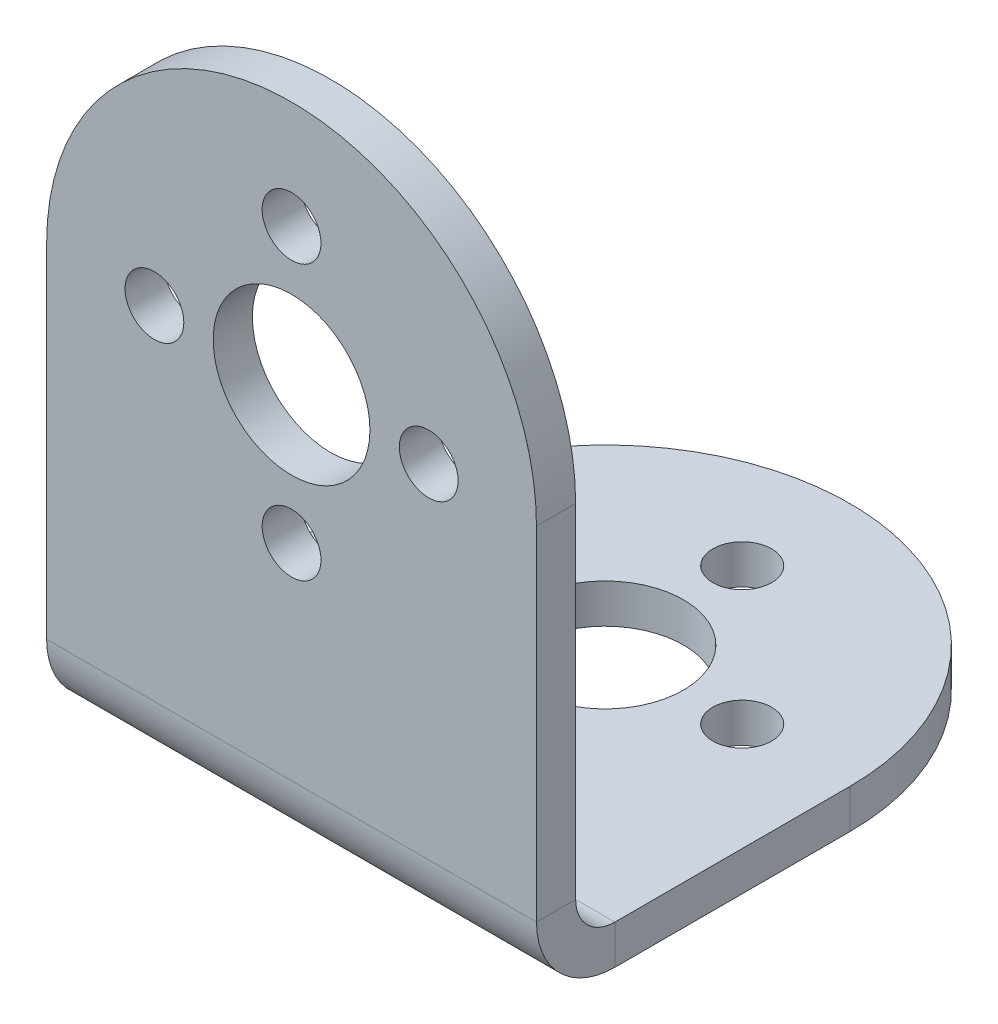
ISO-10303-21;
HEADER;
FILE_DESCRIPTION(('STEP AP214'),'2;1');
FILE_NAME('part.step','',(''),(''),'','','');
FILE_SCHEMA(('AUTOMOTIVE_DESIGN { 1 0 10303 214 1 1 1 1 }'));
ENDSEC;
DATA;
#1=APPLICATION_CONTEXT('core data for automotive mechanical design processes');
#2=APPLICATION_PROTOCOL_DEFINITION('international standard','automotive_design',2000,#1);
#3=PRODUCT_CONTEXT('',#1,'mechanical');
#4=PRODUCT('Part','Part','',(#3));
#5=PRODUCT_RELATED_PRODUCT_CATEGORY('part','',(#4));
#6=PRODUCT_DEFINITION_FORMATION('','',#4);
#7=PRODUCT_DEFINITION_CONTEXT('part definition',#1,'design');
#8=PRODUCT_DEFINITION('design','',#6,#7);
#9=PRODUCT_DEFINITION_SHAPE('','',#8);
#10=(LENGTH_UNIT() NAMED_UNIT(*) SI_UNIT(.MILLI.,.METRE.));
#11=(NAMED_UNIT(*) PLANE_ANGLE_UNIT() SI_UNIT($,.RADIAN.));
#12=(NAMED_UNIT(*) SI_UNIT($,.STERADIAN.) SOLID_ANGLE_UNIT());
#13=UNCERTAINTY_MEASURE_WITH_UNIT(LENGTH_MEASURE(1.E-05),#10,'distance_accuracy_value','');
#14=(GEOMETRIC_REPRESENTATION_CONTEXT(3) GLOBAL_UNCERTAINTY_ASSIGNED_CONTEXT((#13)) GLOBAL_UNIT_ASSIGNED_CONTEXT((#10,
#11,#12)) REPRESENTATION_CONTEXT('',''));
#15=CARTESIAN_POINT('',(0.,0.,0.));
#16=DIRECTION('',(0.,0.,1.));
#17=DIRECTION('',(1.,0.,0.));
#18=AXIS2_PLACEMENT_3D('',#15,#16,#17);
#19=CARTESIAN_POINT('',(0.,-1.99999999999999,0.));
#20=DIRECTION('',(0.,1.,0.));
#21=DIRECTION('',(0.,0.,1.));
#22=AXIS2_PLACEMENT_3D('',#19,#20,#21);
#23=PLANE('',#22);
#24=CARTESIAN_POINT('',(7.,-2.00000000000019,-16.));
#25=DIRECTION('',(0.,1.,0.));
#26=DIRECTION('',(0.,0.,1.));
#27=AXIS2_PLACEMENT_3D('',#24,#25,#26);
#28=CIRCLE('',#27,1.5);
#29=CARTESIAN_POINT('',(7.,-2.00000000000019,-14.5));
#30=VERTEX_POINT('',#29);
#31=EDGE_CURVE('E575',#30,#30,#28,.T.);
#32=ORIENTED_EDGE('',*,*,#31,.T.);
#33=EDGE_LOOP('',(#32));
#34=FACE_BOUND('',#33,.T.);
#35=CARTESIAN_POINT('',(-7.,-2.00000000000019,-16.));
#36=DIRECTION('',(0.,1.,0.));
#37=DIRECTION('',(0.,0.,1.));
#38=AXIS2_PLACEMENT_3D('',#35,#36,#37);
#39=CIRCLE('',#38,1.5);
#40=CARTESIAN_POINT('',(-7.,-2.00000000000019,-14.5));
#41=VERTEX_POINT('',#40);
#42=EDGE_CURVE('E569',#41,#41,#39,.T.);
#43=ORIENTED_EDGE('',*,*,#42,.T.);
#44=EDGE_LOOP('',(#43));
#45=FACE_BOUND('',#44,.T.);
#46=CARTESIAN_POINT('',(0.,-2.00000000000021,-23.));
#47=DIRECTION('',(0.,1.,0.));
#48=DIRECTION('',(0.,0.,1.));
#49=AXIS2_PLACEMENT_3D('',#46,#47,#48);
#50=CIRCLE('',#49,1.5);
#51=CARTESIAN_POINT('',(0.,-2.00000000000021,-21.5));
#52=VERTEX_POINT('',#51);
#53=EDGE_CURVE('E563',#52,#52,#50,.T.);
#54=ORIENTED_EDGE('',*,*,#53,.T.);
#55=EDGE_LOOP('',(#54));
#56=FACE_BOUND('',#55,.T.);
#57=CARTESIAN_POINT('',(0.,-2.00000000000017,-8.99999999999999));
#58=DIRECTION('',(0.,1.,0.));
#59=DIRECTION('',(0.,0.,1.));
#60=AXIS2_PLACEMENT_3D('',#57,#58,#59);
#61=CIRCLE('',#60,1.5);
#62=CARTESIAN_POINT('',(0.,-2.00000000000016,-7.49999999999999));
#63=VERTEX_POINT('',#62);
#64=EDGE_CURVE('E170',#63,#63,#61,.T.);
#65=ORIENTED_EDGE('',*,*,#64,.T.);
#66=EDGE_LOOP('',(#65));
#67=FACE_BOUND('',#66,.T.);
#68=CARTESIAN_POINT('',(0.,-2.00000000000015,-16.));
#69=DIRECTION('',(0.,1.,0.));
#70=DIRECTION('',(0.,0.,1.));
#71=AXIS2_PLACEMENT_3D('',#68,#69,#70);
#72=CIRCLE('',#71,4.);
#73=CARTESIAN_POINT('',(0.,-2.00000000000013,-12.));
#74=VERTEX_POINT('',#73);
#75=EDGE_CURVE('E551',#74,#74,#72,.T.);
#76=ORIENTED_EDGE('',*,*,#75,.T.);
#77=EDGE_LOOP('',(#76));
#78=FACE_BOUND('',#77,.T.);
#79=CARTESIAN_POINT('',(0.,-2.00000000000006,-16.));
#80=DIRECTION('',(0.,1.,0.));
#81=DIRECTION('',(0.,0.,1.));
#82=AXIS2_PLACEMENT_3D('',#79,#80,#81);
#83=CIRCLE('',#82,12.5);
#84=CARTESIAN_POINT('',(12.5,-2.00000000000005,-16.));
#85=VERTEX_POINT('',#84);
#86=CARTESIAN_POINT('',(-12.5,-2.00000000000005,-16.));
#87=VERTEX_POINT('',#86);
#88=EDGE_CURVE('E162',#85,#87,#83,.T.);
#89=ORIENTED_EDGE('',*,*,#88,.F.);
#90=DIRECTION('',(0.,0.,1.));
#91=VECTOR('',#90,1.);
#92=CARTESIAN_POINT('',(12.5,-2.,-1.99999999999999));
#93=LINE('',#92,#91);
#94=CARTESIAN_POINT('',(12.5,-2.,-3.99999999999999));
#95=VERTEX_POINT('',#94);
#96=EDGE_CURVE('E169',#85,#95,#93,.T.);
#97=ORIENTED_EDGE('',*,*,#96,.T.);
#98=DIRECTION('',(1.,0.,0.));
#99=VECTOR('',#98,1.);
#100=CARTESIAN_POINT('',(0.,-2.00000000000001,-3.99999999999999));
#101=LINE('',#100,#99);
#102=CARTESIAN_POINT('',(-12.5,-2.00000000000001,-3.99999999999999));
#103=VERTEX_POINT('',#102);
#104=EDGE_CURVE('E180',#103,#95,#101,.T.);
#105=ORIENTED_EDGE('',*,*,#104,.F.);
#106=DIRECTION('',(0.,0.,-1.));
#107=VECTOR('',#106,1.);
#108=CARTESIAN_POINT('',(-12.5,-2.00000000000009,-28.5));
#109=LINE('',#108,#107);
#110=EDGE_CURVE('E175',#103,#87,#109,.T.);
#111=ORIENTED_EDGE('',*,*,#110,.T.);
#112=EDGE_LOOP('',(#89,#97,#105,#111));
#113=FACE_BOUND('',#112,.T.);
#114=ADVANCED_FACE('F85',(#34,#45,#56,#67,#78,#113),#23,.F.);
#115=CARTESIAN_POINT('',(0.,0.,0.));
#116=DIRECTION('',(0.,1.,0.));
#117=DIRECTION('',(0.,0.,1.));
#118=AXIS2_PLACEMENT_3D('',#115,#116,#117);
#119=PLANE('',#118);
#120=CARTESIAN_POINT('',(7.,0.,-16.));
#121=DIRECTION('',(0.,1.,0.));
#122=DIRECTION('',(0.,0.,1.));
#123=AXIS2_PLACEMENT_3D('',#120,#121,#122);
#124=CIRCLE('',#123,1.49999999999999);
#125=CARTESIAN_POINT('',(7.,0.,-14.5));
#126=VERTEX_POINT('',#125);
#127=EDGE_CURVE('E577',#126,#126,#124,.T.);
#128=ORIENTED_EDGE('',*,*,#127,.F.);
#129=EDGE_LOOP('',(#128));
#130=FACE_BOUND('',#129,.T.);
#131=CARTESIAN_POINT('',(-7.,0.,-16.));
#132=DIRECTION('',(0.,1.,0.));
#133=DIRECTION('',(0.,0.,1.));
#134=AXIS2_PLACEMENT_3D('',#131,#132,#133);
#135=CIRCLE('',#134,1.49999999999999);
#136=CARTESIAN_POINT('',(-7.,0.,-14.5));
#137=VERTEX_POINT('',#136);
#138=EDGE_CURVE('E572',#137,#137,#135,.T.);
#139=ORIENTED_EDGE('',*,*,#138,.F.);
#140=EDGE_LOOP('',(#139));
#141=FACE_BOUND('',#140,.T.);
#142=CARTESIAN_POINT('',(0.,0.,-23.));
#143=DIRECTION('',(0.,1.,0.));
#144=DIRECTION('',(0.,0.,1.));
#145=AXIS2_PLACEMENT_3D('',#142,#143,#144);
#146=CIRCLE('',#145,1.49999999999999);
#147=CARTESIAN_POINT('',(0.,0.,-21.5));
#148=VERTEX_POINT('',#147);
#149=EDGE_CURVE('E566',#148,#148,#146,.T.);
#150=ORIENTED_EDGE('',*,*,#149,.F.);
#151=EDGE_LOOP('',(#150));
#152=FACE_BOUND('',#151,.T.);
#153=CARTESIAN_POINT('',(0.,0.,-8.99999999999999));
#154=DIRECTION('',(0.,1.,0.));
#155=DIRECTION('',(0.,0.,1.));
#156=AXIS2_PLACEMENT_3D('',#153,#154,#155);
#157=CIRCLE('',#156,1.49999999999999);
#158=CARTESIAN_POINT('',(0.,0.,-7.50000000000001));
#159=VERTEX_POINT('',#158);
#160=EDGE_CURVE('E560',#159,#159,#157,.T.);
#161=ORIENTED_EDGE('',*,*,#160,.F.);
#162=EDGE_LOOP('',(#161));
#163=FACE_BOUND('',#162,.T.);
#164=CARTESIAN_POINT('',(0.,-1.48318857196017E-13,-16.));
#165=DIRECTION('',(0.,1.,0.));
#166=DIRECTION('',(0.,0.,1.));
#167=AXIS2_PLACEMENT_3D('',#164,#165,#166);
#168=CIRCLE('',#167,4.);
#169=CARTESIAN_POINT('',(0.,-1.34352931840644E-13,-12.));
#170=VERTEX_POINT('',#169);
#171=EDGE_CURVE('E550',#170,#170,#168,.T.);
#172=ORIENTED_EDGE('',*,*,#171,.F.);
#173=EDGE_LOOP('',(#172));
#174=FACE_BOUND('',#173,.T.);
#175=DIRECTION('',(0.,0.,1.));
#176=VECTOR('',#175,1.);
#177=CARTESIAN_POINT('',(12.5,0.,-2.));
#178=LINE('',#177,#176);
#179=CARTESIAN_POINT('',(12.5,0.,-16.));
#180=VERTEX_POINT('',#179);
#181=CARTESIAN_POINT('',(12.5,0.,-3.99999999999999));
#182=VERTEX_POINT('',#181);
#183=EDGE_CURVE('E167',#180,#182,#178,.T.);
#184=ORIENTED_EDGE('',*,*,#183,.F.);
#185=CARTESIAN_POINT('',(0.,0.,-16.));
#186=DIRECTION('',(0.,1.,0.));
#187=DIRECTION('',(0.,0.,1.));
#188=AXIS2_PLACEMENT_3D('',#185,#186,#187);
#189=CIRCLE('',#188,12.5);
#190=CARTESIAN_POINT('',(-12.5,0.,-16.));
#191=VERTEX_POINT('',#190);
#192=EDGE_CURVE('E151',#180,#191,#189,.T.);
#193=ORIENTED_EDGE('',*,*,#192,.T.);
#194=DIRECTION('',(0.,0.,-1.));
#195=VECTOR('',#194,1.);
#196=CARTESIAN_POINT('',(-12.5,0.,-28.5));
#197=LINE('',#196,#195);
#198=CARTESIAN_POINT('',(-12.5,0.,-3.99999999999999));
#199=VERTEX_POINT('',#198);
#200=EDGE_CURVE('E176',#199,#191,#197,.T.);
#201=ORIENTED_EDGE('',*,*,#200,.F.);
#202=DIRECTION('',(-1.,0.,0.));
#203=VECTOR('',#202,1.);
#204=CARTESIAN_POINT('',(12.5,0.,-3.99999999999999));
#205=LINE('',#204,#203);
#206=EDGE_CURVE('E174',#182,#199,#205,.T.);
#207=ORIENTED_EDGE('',*,*,#206,.F.);
#208=EDGE_LOOP('',(#184,#193,#201,#207));
#209=FACE_BOUND('',#208,.T.);
#210=ADVANCED_FACE('F173',(#130,#141,#152,#163,#174,#209),#119,.T.);
#211=CARTESIAN_POINT('',(-12.5,-2.00000000000009,-28.5));
#212=DIRECTION('',(1.,0.,0.));
#213=DIRECTION('',(0.,0.,-1.));
#214=AXIS2_PLACEMENT_3D('',#211,#212,#213);
#215=PLANE('',#214);
#216=DIRECTION('',(0.,1.,0.));
#217=VECTOR('',#216,1.);
#218=CARTESIAN_POINT('',(-12.5,0.,-16.));
#219=LINE('',#218,#217);
#220=EDGE_CURVE('E157',#191,#87,#219,.F.);
#221=ORIENTED_EDGE('',*,*,#220,.T.);
#222=ORIENTED_EDGE('',*,*,#110,.F.);
#223=DIRECTION('',(0.,-1.,0.));
#224=VECTOR('',#223,1.);
#225=CARTESIAN_POINT('',(-12.5,0.,-3.99999999999999));
#226=LINE('',#225,#224);
#227=EDGE_CURVE('E238',#199,#103,#226,.T.);
#228=ORIENTED_EDGE('',*,*,#227,.F.);
#229=ORIENTED_EDGE('',*,*,#200,.T.);
#230=EDGE_LOOP('',(#221,#222,#228,#229));
#231=FACE_BOUND('',#230,.T.);
#232=ADVANCED_FACE('F271',(#231),#215,.F.);
#233=CARTESIAN_POINT('',(-12.5,0.,-2.));
#234=DIRECTION('',(-1.,0.,0.));
#235=DIRECTION('',(0.,0.,1.));
#236=AXIS2_PLACEMENT_3D('',#233,#234,#235);
#237=PLANE('',#236);
#238=DIRECTION('',(0.,-1.,0.));
#239=VECTOR('',#238,1.);
#240=CARTESIAN_POINT('',(-12.5,0.,-2.));
#241=LINE('',#240,#239);
#242=CARTESIAN_POINT('',(-12.5,19.5,-2.));
#243=VERTEX_POINT('',#242);
#244=CARTESIAN_POINT('',(-12.5,2.,-2.));
#245=VERTEX_POINT('',#244);
#246=EDGE_CURVE('E205',#243,#245,#241,.T.);
#247=ORIENTED_EDGE('',*,*,#246,.T.);
#248=DIRECTION('',(0.,0.,1.));
#249=VECTOR('',#248,1.);
#250=CARTESIAN_POINT('',(-12.5,1.99999999999999,-2.));
#251=LINE('',#250,#249);
#252=CARTESIAN_POINT('',(-12.5,1.99999999999999,0.));
#253=VERTEX_POINT('',#252);
#254=EDGE_CURVE('E191',#245,#253,#251,.T.);
#255=ORIENTED_EDGE('',*,*,#254,.T.);
#256=DIRECTION('',(0.,-1.,0.));
#257=VECTOR('',#256,1.);
#258=CARTESIAN_POINT('',(-12.5,0.,0.));
#259=LINE('',#258,#257);
#260=CARTESIAN_POINT('',(-12.5,19.5,0.));
#261=VERTEX_POINT('',#260);
#262=EDGE_CURVE('E203',#261,#253,#259,.T.);
#263=ORIENTED_EDGE('',*,*,#262,.F.);
#264=DIRECTION('',(0.,0.,1.));
#265=VECTOR('',#264,1.);
#266=CARTESIAN_POINT('',(-12.5,19.5,-2.));
#267=LINE('',#266,#265);
#268=EDGE_CURVE('E12',#243,#261,#267,.T.);
#269=ORIENTED_EDGE('',*,*,#268,.F.);
#270=EDGE_LOOP('',(#247,#255,#263,#269));
#271=FACE_BOUND('',#270,.T.);
#272=ADVANCED_FACE('F87',(#271),#237,.T.);
#273=CARTESIAN_POINT('',(0.,19.5,-2.));
#274=DIRECTION('',(0.,0.,-1.));
#275=DIRECTION('',(-1.,0.,0.));
#276=AXIS2_PLACEMENT_3D('',#273,#274,#275);
#277=PLANE('',#276);
#278=CARTESIAN_POINT('',(0.,26.5,-2.));
#279=DIRECTION('',(0.,0.,-1.));
#280=DIRECTION('',(-1.,0.,0.));
#281=AXIS2_PLACEMENT_3D('',#278,#279,#280);
#282=CIRCLE('',#281,1.49999999999999);
#283=CARTESIAN_POINT('',(-1.49999999999999,26.5,-2.));
#284=VERTEX_POINT('',#283);
#285=EDGE_CURVE('E546',#284,#284,#282,.T.);
#286=ORIENTED_EDGE('',*,*,#285,.F.);
#287=EDGE_LOOP('',(#286));
#288=FACE_BOUND('',#287,.T.);
#289=CARTESIAN_POINT('',(-7.,19.5,-2.));
#290=DIRECTION('',(0.,0.,-1.));
#291=DIRECTION('',(-1.,0.,0.));
#292=AXIS2_PLACEMENT_3D('',#289,#290,#291);
#293=CIRCLE('',#292,1.49999999999999);
#294=CARTESIAN_POINT('',(-8.49999999999999,19.5,-2.));
#295=VERTEX_POINT('',#294);
#296=EDGE_CURVE('E542',#295,#295,#293,.T.);
#297=ORIENTED_EDGE('',*,*,#296,.F.);
#298=EDGE_LOOP('',(#297));
#299=FACE_BOUND('',#298,.T.);
#300=CARTESIAN_POINT('',(0.,12.5,-2.));
#301=DIRECTION('',(0.,0.,-1.));
#302=DIRECTION('',(-1.,0.,0.));
#303=AXIS2_PLACEMENT_3D('',#300,#301,#302);
#304=CIRCLE('',#303,1.49999999999999);
#305=CARTESIAN_POINT('',(-1.49999999999999,12.5,-2.));
#306=VERTEX_POINT('',#305);
#307=EDGE_CURVE('E538',#306,#306,#304,.T.);
#308=ORIENTED_EDGE('',*,*,#307,.F.);
#309=EDGE_LOOP('',(#308));
#310=FACE_BOUND('',#309,.T.);
#311=CARTESIAN_POINT('',(7.,19.5,-2.));
#312=DIRECTION('',(0.,0.,-1.));
#313=DIRECTION('',(-1.,0.,0.));
#314=AXIS2_PLACEMENT_3D('',#311,#312,#313);
#315=CIRCLE('',#314,1.49999999999999);
#316=CARTESIAN_POINT('',(5.50000000000001,19.5,-2.));
#317=VERTEX_POINT('',#316);
#318=EDGE_CURVE('E532',#317,#317,#315,.T.);
#319=ORIENTED_EDGE('',*,*,#318,.F.);
#320=EDGE_LOOP('',(#319));
#321=FACE_BOUND('',#320,.T.);
#322=CARTESIAN_POINT('',(0.,19.5,-2.));
#323=DIRECTION('',(0.,0.,-1.));
#324=DIRECTION('',(-1.,0.,0.));
#325=AXIS2_PLACEMENT_3D('',#322,#323,#324);
#326=CIRCLE('',#325,4.);
#327=CARTESIAN_POINT('',(-4.,19.5,-2.));
#328=VERTEX_POINT('',#327);
#329=EDGE_CURVE('E242',#328,#328,#326,.T.);
#330=ORIENTED_EDGE('',*,*,#329,.F.);
#331=EDGE_LOOP('',(#330));
#332=FACE_BOUND('',#331,.T.);
#333=DIRECTION('',(0.,1.,0.));
#334=VECTOR('',#333,1.);
#335=CARTESIAN_POINT('',(12.5,0.,-2.));
#336=LINE('',#335,#334);
#337=CARTESIAN_POINT('',(12.5,2.,-2.));
#338=VERTEX_POINT('',#337);
#339=CARTESIAN_POINT('',(12.5,19.5,-2.));
#340=VERTEX_POINT('',#339);
#341=EDGE_CURVE('E207',#338,#340,#336,.T.);
#342=ORIENTED_EDGE('',*,*,#341,.F.);
#343=DIRECTION('',(-1.,0.,0.));
#344=VECTOR('',#343,1.);
#345=CARTESIAN_POINT('',(-12.5,1.99999999999999,-2.));
#346=LINE('',#345,#344);
#347=EDGE_CURVE('E107',#245,#338,#346,.F.);
#348=ORIENTED_EDGE('',*,*,#347,.F.);
#349=ORIENTED_EDGE('',*,*,#246,.F.);
#350=CARTESIAN_POINT('',(0.,19.5,-2.));
#351=DIRECTION('',(0.,0.,1.));
#352=DIRECTION('',(-1.,0.,0.));
#353=AXIS2_PLACEMENT_3D('',#350,#351,#352);
#354=CIRCLE('',#353,12.5);
#355=EDGE_CURVE('E210',#340,#243,#354,.T.);
#356=ORIENTED_EDGE('',*,*,#355,.F.);
#357=EDGE_LOOP('',(#342,#348,#349,#356));
#358=FACE_BOUND('',#357,.T.);
#359=ADVANCED_FACE('F466',(#288,#299,#310,#321,#332,#358),#277,.T.);
#360=CARTESIAN_POINT('',(0.,19.5,0.));
#361=DIRECTION('',(0.,0.,-1.));
#362=DIRECTION('',(-1.,0.,0.));
#363=AXIS2_PLACEMENT_3D('',#360,#361,#362);
#364=PLANE('',#363);
#365=CARTESIAN_POINT('',(0.,26.5,0.));
#366=DIRECTION('',(0.,0.,1.));
#367=DIRECTION('',(1.,0.,0.));
#368=AXIS2_PLACEMENT_3D('',#365,#366,#367);
#369=CIRCLE('',#368,1.49999999999999);
#370=CARTESIAN_POINT('',(1.49999999999999,26.5,0.));
#371=VERTEX_POINT('',#370);
#372=EDGE_CURVE('E515',#371,#371,#369,.T.);
#373=ORIENTED_EDGE('',*,*,#372,.F.);
#374=EDGE_LOOP('',(#373));
#375=FACE_BOUND('',#374,.T.);
#376=CARTESIAN_POINT('',(-7.,19.5,0.));
#377=DIRECTION('',(0.,0.,1.));
#378=DIRECTION('',(1.,0.,0.));
#379=AXIS2_PLACEMENT_3D('',#376,#377,#378);
#380=CIRCLE('',#379,1.49999999999999);
#381=CARTESIAN_POINT('',(-5.50000000000001,19.5,0.));
#382=VERTEX_POINT('',#381);
#383=EDGE_CURVE('E519',#382,#382,#380,.T.);
#384=ORIENTED_EDGE('',*,*,#383,.F.);
#385=EDGE_LOOP('',(#384));
#386=FACE_BOUND('',#385,.T.);
#387=CARTESIAN_POINT('',(0.,12.5,0.));
#388=DIRECTION('',(0.,0.,1.));
#389=DIRECTION('',(1.,0.,0.));
#390=AXIS2_PLACEMENT_3D('',#387,#388,#389);
#391=CIRCLE('',#390,1.49999999999999);
#392=CARTESIAN_POINT('',(1.49999999999999,12.5,0.));
#393=VERTEX_POINT('',#392);
#394=EDGE_CURVE('E523',#393,#393,#391,.T.);
#395=ORIENTED_EDGE('',*,*,#394,.F.);
#396=EDGE_LOOP('',(#395));
#397=FACE_BOUND('',#396,.T.);
#398=CARTESIAN_POINT('',(7.,19.5,0.));
#399=DIRECTION('',(0.,0.,1.));
#400=DIRECTION('',(1.,0.,0.));
#401=AXIS2_PLACEMENT_3D('',#398,#399,#400);
#402=CIRCLE('',#401,1.49999999999999);
#403=CARTESIAN_POINT('',(8.49999999999999,19.5,0.));
#404=VERTEX_POINT('',#403);
#405=EDGE_CURVE('E527',#404,#404,#402,.T.);
#406=ORIENTED_EDGE('',*,*,#405,.F.);
#407=EDGE_LOOP('',(#406));
#408=FACE_BOUND('',#407,.T.);
#409=CARTESIAN_POINT('',(0.,19.5,0.));
#410=DIRECTION('',(0.,0.,1.));
#411=DIRECTION('',(1.,0.,0.));
#412=AXIS2_PLACEMENT_3D('',#409,#410,#411);
#413=CIRCLE('',#412,4.);
#414=CARTESIAN_POINT('',(4.,19.5,0.));
#415=VERTEX_POINT('',#414);
#416=EDGE_CURVE('E530',#415,#415,#413,.T.);
#417=ORIENTED_EDGE('',*,*,#416,.F.);
#418=EDGE_LOOP('',(#417));
#419=FACE_BOUND('',#418,.T.);
#420=DIRECTION('',(-1.,0.,0.));
#421=VECTOR('',#420,1.);
#422=CARTESIAN_POINT('',(-12.5,1.99999999999999,0.));
#423=LINE('',#422,#421);
#424=CARTESIAN_POINT('',(12.5,2.,0.));
#425=VERTEX_POINT('',#424);
#426=EDGE_CURVE('E184',#253,#425,#423,.F.);
#427=ORIENTED_EDGE('',*,*,#426,.T.);
#428=DIRECTION('',(0.,1.,0.));
#429=VECTOR('',#428,1.);
#430=CARTESIAN_POINT('',(12.5,0.,0.));
#431=LINE('',#430,#429);
#432=CARTESIAN_POINT('',(12.5,19.5,0.));
#433=VERTEX_POINT('',#432);
#434=EDGE_CURVE('E215',#425,#433,#431,.T.);
#435=ORIENTED_EDGE('',*,*,#434,.T.);
#436=CARTESIAN_POINT('',(0.,19.5,0.));
#437=DIRECTION('',(0.,0.,1.));
#438=DIRECTION('',(-1.,0.,0.));
#439=AXIS2_PLACEMENT_3D('',#436,#437,#438);
#440=CIRCLE('',#439,12.5);
#441=EDGE_CURVE('E208',#433,#261,#440,.T.);
#442=ORIENTED_EDGE('',*,*,#441,.T.);
#443=ORIENTED_EDGE('',*,*,#262,.T.);
#444=EDGE_LOOP('',(#427,#435,#442,#443));
#445=FACE_BOUND('',#444,.T.);
#446=ADVANCED_FACE('F220',(#375,#386,#397,#408,#419,#445),#364,.F.);
#447=CARTESIAN_POINT('',(0.,19.5,-2.));
#448=DIRECTION('',(0.,0.,1.));
#449=DIRECTION('',(1.,0.,0.));
#450=AXIS2_PLACEMENT_3D('',#447,#448,#449);
#451=CYLINDRICAL_SURFACE('',#450,12.5);
#452=ORIENTED_EDGE('',*,*,#441,.F.);
#453=DIRECTION('',(0.,0.,1.));
#454=VECTOR('',#453,1.);
#455=CARTESIAN_POINT('',(12.5,19.5,-2.));
#456=LINE('',#455,#454);
#457=EDGE_CURVE('E89',#340,#433,#456,.T.);
#458=ORIENTED_EDGE('',*,*,#457,.F.);
#459=ORIENTED_EDGE('',*,*,#355,.T.);
#460=ORIENTED_EDGE('',*,*,#268,.T.);
#461=EDGE_LOOP('',(#452,#458,#459,#460));
#462=FACE_BOUND('',#461,.T.);
#463=ADVANCED_FACE('F226',(#462),#451,.T.);
#464=CARTESIAN_POINT('',(12.5,0.,-2.));
#465=DIRECTION('',(1.,0.,0.));
#466=DIRECTION('',(0.,1.,0.));
#467=AXIS2_PLACEMENT_3D('',#464,#465,#466);
#468=PLANE('',#467);
#469=DIRECTION('',(0.,0.,1.));
#470=VECTOR('',#469,1.);
#471=CARTESIAN_POINT('',(12.5,2.,-2.));
#472=LINE('',#471,#470);
#473=EDGE_CURVE('E100',#338,#425,#472,.T.);
#474=ORIENTED_EDGE('',*,*,#473,.F.);
#475=ORIENTED_EDGE('',*,*,#341,.T.);
#476=ORIENTED_EDGE('',*,*,#457,.T.);
#477=ORIENTED_EDGE('',*,*,#434,.F.);
#478=EDGE_LOOP('',(#474,#475,#476,#477));
#479=FACE_BOUND('',#478,.T.);
#480=ADVANCED_FACE('F257',(#479),#468,.T.);
#481=CARTESIAN_POINT('',(12.5,2.,-4.));
#482=DIRECTION('',(1.,0.,0.));
#483=DIRECTION('',(0.,1.,0.));
#484=AXIS2_PLACEMENT_3D('',#481,#482,#483);
#485=PLANE('',#484);
#486=DIRECTION('',(0.,-1.,0.));
#487=VECTOR('',#486,1.);
#488=CARTESIAN_POINT('',(12.5,0.,-3.99999999999999));
#489=LINE('',#488,#487);
#490=EDGE_CURVE('E239',#182,#95,#489,.T.);
#491=ORIENTED_EDGE('',*,*,#490,.F.);
#492=CARTESIAN_POINT('',(12.5,2.,-4.));
#493=DIRECTION('',(-1.,0.,0.));
#494=DIRECTION('',(0.,-1.,0.));
#495=AXIS2_PLACEMENT_3D('',#492,#493,#494);
#496=CIRCLE('',#495,2.);
#497=EDGE_CURVE('E194',#338,#182,#496,.F.);
#498=ORIENTED_EDGE('',*,*,#497,.F.);
#499=ORIENTED_EDGE('',*,*,#473,.T.);
#500=CARTESIAN_POINT('',(12.5,2.,-4.));
#501=DIRECTION('',(-1.,0.,0.));
#502=DIRECTION('',(0.,-1.,0.));
#503=AXIS2_PLACEMENT_3D('',#500,#501,#502);
#504=CIRCLE('',#503,4.);
#505=EDGE_CURVE('E187',#425,#95,#504,.F.);
#506=ORIENTED_EDGE('',*,*,#505,.T.);
#507=EDGE_LOOP('',(#491,#498,#499,#506));
#508=FACE_BOUND('',#507,.T.);
#509=ADVANCED_FACE('F255',(#508),#485,.T.);
#510=CARTESIAN_POINT('',(-12.5,1.99999999999999,-4.));
#511=DIRECTION('',(1.,0.,0.));
#512=DIRECTION('',(0.,1.,0.));
#513=AXIS2_PLACEMENT_3D('',#510,#511,#512);
#514=PLANE('',#513);
#515=CARTESIAN_POINT('',(-12.5,1.99999999999999,-4.));
#516=DIRECTION('',(-1.,0.,0.));
#517=DIRECTION('',(0.,-1.,0.));
#518=AXIS2_PLACEMENT_3D('',#515,#516,#517);
#519=CIRCLE('',#518,2.);
#520=EDGE_CURVE('E199',#199,#245,#519,.T.);
#521=ORIENTED_EDGE('',*,*,#520,.F.);
#522=ORIENTED_EDGE('',*,*,#227,.T.);
#523=CARTESIAN_POINT('',(-12.5,1.99999999999999,-4.));
#524=DIRECTION('',(-1.,0.,0.));
#525=DIRECTION('',(0.,-1.,0.));
#526=AXIS2_PLACEMENT_3D('',#523,#524,#525);
#527=CIRCLE('',#526,4.);
#528=EDGE_CURVE('E188',#103,#253,#527,.T.);
#529=ORIENTED_EDGE('',*,*,#528,.T.);
#530=ORIENTED_EDGE('',*,*,#254,.F.);
#531=EDGE_LOOP('',(#521,#522,#529,#530));
#532=FACE_BOUND('',#531,.T.);
#533=ADVANCED_FACE('F232',(#532),#514,.F.);
#534=CARTESIAN_POINT('',(-12.5,1.99999999999999,-4.));
#535=DIRECTION('',(-1.,0.,0.));
#536=DIRECTION('',(0.,-1.,0.));
#537=AXIS2_PLACEMENT_3D('',#534,#535,#536);
#538=CYLINDRICAL_SURFACE('',#537,4.);
#539=ORIENTED_EDGE('',*,*,#426,.F.);
#540=ORIENTED_EDGE('',*,*,#528,.F.);
#541=ORIENTED_EDGE('',*,*,#104,.T.);
#542=ORIENTED_EDGE('',*,*,#505,.F.);
#543=EDGE_LOOP('',(#539,#540,#541,#542));
#544=FACE_BOUND('',#543,.T.);
#545=ADVANCED_FACE('F253',(#544),#538,.T.);
#546=CARTESIAN_POINT('',(-12.5,1.99999999999999,-4.));
#547=DIRECTION('',(-1.,0.,0.));
#548=DIRECTION('',(0.,-1.,0.));
#549=AXIS2_PLACEMENT_3D('',#546,#547,#548);
#550=CYLINDRICAL_SURFACE('',#549,2.);
#551=ORIENTED_EDGE('',*,*,#347,.T.);
#552=ORIENTED_EDGE('',*,*,#497,.T.);
#553=ORIENTED_EDGE('',*,*,#206,.T.);
#554=ORIENTED_EDGE('',*,*,#520,.T.);
#555=EDGE_LOOP('',(#551,#552,#553,#554));
#556=FACE_BOUND('',#555,.T.);
#557=ADVANCED_FACE('F236',(#556),#550,.F.);
#558=CARTESIAN_POINT('',(12.5,-2.,-1.99999999999999));
#559=DIRECTION('',(-1.,0.,0.));
#560=DIRECTION('',(0.,-1.,0.));
#561=AXIS2_PLACEMENT_3D('',#558,#559,#560);
#562=PLANE('',#561);
#563=ORIENTED_EDGE('',*,*,#96,.F.);
#564=DIRECTION('',(0.,1.,0.));
#565=VECTOR('',#564,1.);
#566=CARTESIAN_POINT('',(12.5,0.,-16.));
#567=LINE('',#566,#565);
#568=EDGE_CURVE('E154',#180,#85,#567,.F.);
#569=ORIENTED_EDGE('',*,*,#568,.F.);
#570=ORIENTED_EDGE('',*,*,#183,.T.);
#571=ORIENTED_EDGE('',*,*,#490,.T.);
#572=EDGE_LOOP('',(#563,#569,#570,#571));
#573=FACE_BOUND('',#572,.T.);
#574=ADVANCED_FACE('F165',(#573),#562,.F.);
#575=CARTESIAN_POINT('',(0.,19.5,-28.5));
#576=DIRECTION('',(0.,0.,1.));
#577=DIRECTION('',(1.,0.,0.));
#578=AXIS2_PLACEMENT_3D('',#575,#576,#577);
#579=CYLINDRICAL_SURFACE('',#578,4.);
#580=ORIENTED_EDGE('',*,*,#329,.T.);
#581=EDGE_LOOP('',(#580));
#582=FACE_BOUND('',#581,.T.);
#583=ORIENTED_EDGE('',*,*,#416,.T.);
#584=EDGE_LOOP('',(#583));
#585=FACE_BOUND('',#584,.T.);
#586=ADVANCED_FACE('F277',(#582,#585),#579,.F.);
#587=CARTESIAN_POINT('',(7.,19.5,0.));
#588=DIRECTION('',(0.,0.,1.));
#589=DIRECTION('',(1.,0.,0.));
#590=AXIS2_PLACEMENT_3D('',#587,#588,#589);
#591=CYLINDRICAL_SURFACE('',#590,1.49999999999999);
#592=ORIENTED_EDGE('',*,*,#318,.T.);
#593=EDGE_LOOP('',(#592));
#594=FACE_BOUND('',#593,.T.);
#595=ORIENTED_EDGE('',*,*,#405,.T.);
#596=EDGE_LOOP('',(#595));
#597=FACE_BOUND('',#596,.T.);
#598=ADVANCED_FACE('F303',(#594,#597),#591,.F.);
#599=CARTESIAN_POINT('',(0.,12.5,0.));
#600=DIRECTION('',(0.,0.,1.));
#601=DIRECTION('',(1.,0.,0.));
#602=AXIS2_PLACEMENT_3D('',#599,#600,#601);
#603=CYLINDRICAL_SURFACE('',#602,1.49999999999999);
#604=ORIENTED_EDGE('',*,*,#307,.T.);
#605=EDGE_LOOP('',(#604));
#606=FACE_BOUND('',#605,.T.);
#607=ORIENTED_EDGE('',*,*,#394,.T.);
#608=EDGE_LOOP('',(#607));
#609=FACE_BOUND('',#608,.T.);
#610=ADVANCED_FACE('F311',(#606,#609),#603,.F.);
#611=CARTESIAN_POINT('',(-7.,19.5,0.));
#612=DIRECTION('',(0.,0.,1.));
#613=DIRECTION('',(1.,0.,0.));
#614=AXIS2_PLACEMENT_3D('',#611,#612,#613);
#615=CYLINDRICAL_SURFACE('',#614,1.49999999999999);
#616=ORIENTED_EDGE('',*,*,#296,.T.);
#617=EDGE_LOOP('',(#616));
#618=FACE_BOUND('',#617,.T.);
#619=ORIENTED_EDGE('',*,*,#383,.T.);
#620=EDGE_LOOP('',(#619));
#621=FACE_BOUND('',#620,.T.);
#622=ADVANCED_FACE('F319',(#618,#621),#615,.F.);
#623=CARTESIAN_POINT('',(0.,26.5,0.));
#624=DIRECTION('',(0.,0.,1.));
#625=DIRECTION('',(1.,0.,0.));
#626=AXIS2_PLACEMENT_3D('',#623,#624,#625);
#627=CYLINDRICAL_SURFACE('',#626,1.49999999999999);
#628=ORIENTED_EDGE('',*,*,#285,.T.);
#629=EDGE_LOOP('',(#628));
#630=FACE_BOUND('',#629,.T.);
#631=ORIENTED_EDGE('',*,*,#372,.T.);
#632=EDGE_LOOP('',(#631));
#633=FACE_BOUND('',#632,.T.);
#634=ADVANCED_FACE('F327',(#630,#633),#627,.F.);
#635=CARTESIAN_POINT('',(0.,-2.00000000000015,-16.));
#636=DIRECTION('',(0.,1.,0.));
#637=DIRECTION('',(0.,0.,1.));
#638=AXIS2_PLACEMENT_3D('',#635,#636,#637);
#639=CYLINDRICAL_SURFACE('',#638,4.);
#640=ORIENTED_EDGE('',*,*,#171,.T.);
#641=EDGE_LOOP('',(#640));
#642=FACE_BOUND('',#641,.T.);
#643=ORIENTED_EDGE('',*,*,#75,.F.);
#644=EDGE_LOOP('',(#643));
#645=FACE_BOUND('',#644,.T.);
#646=ADVANCED_FACE('F335',(#642,#645),#639,.F.);
#647=CARTESIAN_POINT('',(0.,0.,-16.));
#648=DIRECTION('',(0.,1.,0.));
#649=DIRECTION('',(0.,0.,1.));
#650=AXIS2_PLACEMENT_3D('',#647,#648,#649);
#651=CYLINDRICAL_SURFACE('',#650,12.5);
#652=ORIENTED_EDGE('',*,*,#220,.F.);
#653=ORIENTED_EDGE('',*,*,#192,.F.);
#654=ORIENTED_EDGE('',*,*,#568,.T.);
#655=ORIENTED_EDGE('',*,*,#88,.T.);
#656=EDGE_LOOP('',(#652,#653,#654,#655));
#657=FACE_BOUND('',#656,.T.);
#658=ADVANCED_FACE('F153',(#657),#651,.T.);
#659=CARTESIAN_POINT('',(0.,0.,-8.99999999999999));
#660=DIRECTION('',(0.,1.,0.));
#661=DIRECTION('',(0.,0.,1.));
#662=AXIS2_PLACEMENT_3D('',#659,#660,#661);
#663=CYLINDRICAL_SURFACE('',#662,1.49999999999999);
#664=ORIENTED_EDGE('',*,*,#64,.F.);
#665=EDGE_LOOP('',(#664));
#666=FACE_BOUND('',#665,.T.);
#667=ORIENTED_EDGE('',*,*,#160,.T.);
#668=EDGE_LOOP('',(#667));
#669=FACE_BOUND('',#668,.T.);
#670=ADVANCED_FACE('F349',(#666,#669),#663,.F.);
#671=CARTESIAN_POINT('',(0.,0.,-23.));
#672=DIRECTION('',(0.,1.,0.));
#673=DIRECTION('',(0.,0.,1.));
#674=AXIS2_PLACEMENT_3D('',#671,#672,#673);
#675=CYLINDRICAL_SURFACE('',#674,1.49999999999999);
#676=ORIENTED_EDGE('',*,*,#53,.F.);
#677=EDGE_LOOP('',(#676));
#678=FACE_BOUND('',#677,.T.);
#679=ORIENTED_EDGE('',*,*,#149,.T.);
#680=EDGE_LOOP('',(#679));
#681=FACE_BOUND('',#680,.T.);
#682=ADVANCED_FACE('F356',(#678,#681),#675,.F.);
#683=CARTESIAN_POINT('',(-7.,0.,-16.));
#684=DIRECTION('',(0.,1.,0.));
#685=DIRECTION('',(0.,0.,1.));
#686=AXIS2_PLACEMENT_3D('',#683,#684,#685);
#687=CYLINDRICAL_SURFACE('',#686,1.49999999999999);
#688=ORIENTED_EDGE('',*,*,#42,.F.);
#689=EDGE_LOOP('',(#688));
#690=FACE_BOUND('',#689,.T.);
#691=ORIENTED_EDGE('',*,*,#138,.T.);
#692=EDGE_LOOP('',(#691));
#693=FACE_BOUND('',#692,.T.);
#694=ADVANCED_FACE('F365',(#690,#693),#687,.F.);
#695=CARTESIAN_POINT('',(7.,0.,-16.));
#696=DIRECTION('',(0.,1.,0.));
#697=DIRECTION('',(0.,0.,1.));
#698=AXIS2_PLACEMENT_3D('',#695,#696,#697);
#699=CYLINDRICAL_SURFACE('',#698,1.49999999999999);
#700=ORIENTED_EDGE('',*,*,#31,.F.);
#701=EDGE_LOOP('',(#700));
#702=FACE_BOUND('',#701,.T.);
#703=ORIENTED_EDGE('',*,*,#127,.T.);
#704=EDGE_LOOP('',(#703));
#705=FACE_BOUND('',#704,.T.);
#706=ADVANCED_FACE('F373',(#702,#705),#699,.F.);
#707=CLOSED_SHELL('',(#114,#210,#232,#272,#359,#446,#463,#480,#509,#533,#545,#557,#574,#586,
#598,#610,#622,#634,#646,#658,#670,#682,#694,#706));
#708=MANIFOLD_SOLID_BREP('B2',#707);
#709=ADVANCED_BREP_SHAPE_REPRESENTATION('',(#18,#708),#14);
#710=SHAPE_DEFINITION_REPRESENTATION(#9,#709);
ENDSEC;
END-ISO-10303-21;
